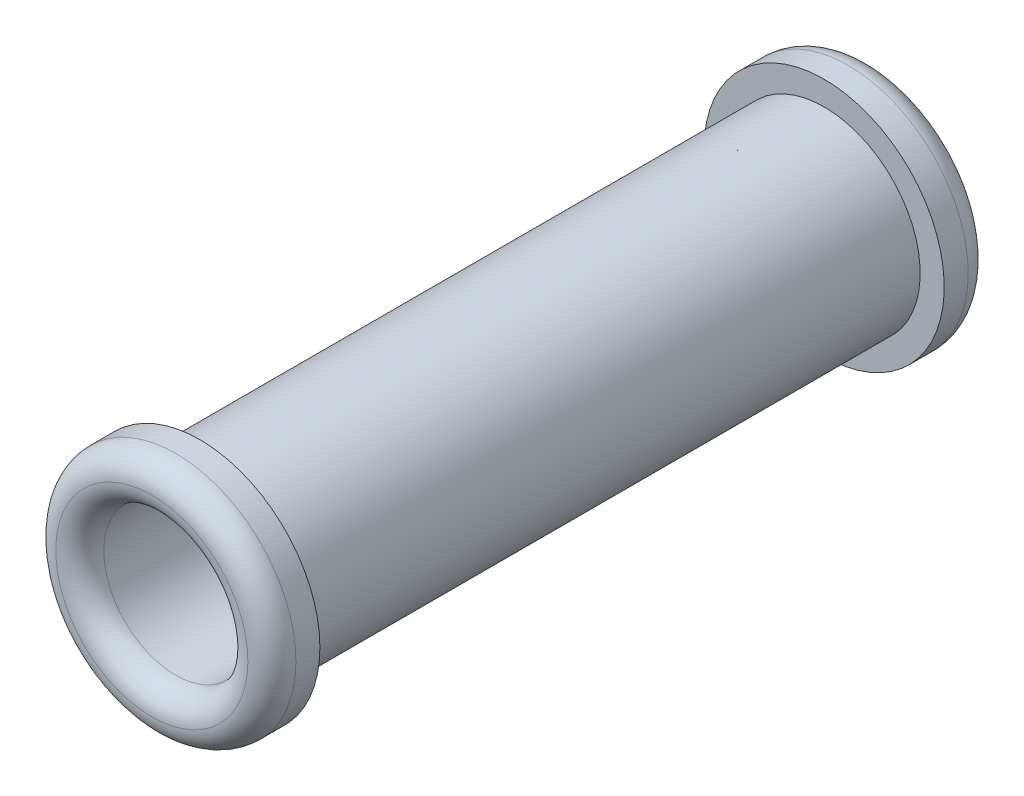
ISO-10303-21;
HEADER;
FILE_DESCRIPTION(('STEP AP214'),'2;1');
FILE_NAME('part.step','',(''),(''),'','','');
FILE_SCHEMA(('AUTOMOTIVE_DESIGN { 1 0 10303 214 1 1 1 1 }'));
ENDSEC;
DATA;
#1=APPLICATION_CONTEXT('core data for automotive mechanical design processes');
#2=APPLICATION_PROTOCOL_DEFINITION('international standard','automotive_design',2000,#1);
#3=PRODUCT_CONTEXT('',#1,'mechanical');
#4=PRODUCT('Part','Part','',(#3));
#5=PRODUCT_RELATED_PRODUCT_CATEGORY('part','',(#4));
#6=PRODUCT_DEFINITION_FORMATION('','',#4);
#7=PRODUCT_DEFINITION_CONTEXT('part definition',#1,'design');
#8=PRODUCT_DEFINITION('design','',#6,#7);
#9=PRODUCT_DEFINITION_SHAPE('','',#8);
#10=(LENGTH_UNIT() NAMED_UNIT(*) SI_UNIT(.MILLI.,.METRE.));
#11=(NAMED_UNIT(*) PLANE_ANGLE_UNIT() SI_UNIT($,.RADIAN.));
#12=(NAMED_UNIT(*) SI_UNIT($,.STERADIAN.) SOLID_ANGLE_UNIT());
#13=UNCERTAINTY_MEASURE_WITH_UNIT(LENGTH_MEASURE(1.E-05),#10,'distance_accuracy_value','');
#14=(GEOMETRIC_REPRESENTATION_CONTEXT(3) GLOBAL_UNCERTAINTY_ASSIGNED_CONTEXT((#13)) GLOBAL_UNIT_ASSIGNED_CONTEXT((#10,
#11,#12)) REPRESENTATION_CONTEXT('',''));
#15=CARTESIAN_POINT('',(0.,0.,0.));
#16=DIRECTION('',(0.,0.,1.));
#17=DIRECTION('',(1.,0.,0.));
#18=AXIS2_PLACEMENT_3D('',#15,#16,#17);
#19=CARTESIAN_POINT('',(0.,0.,6.5));
#20=DIRECTION('',(0.,0.,-1.));
#21=DIRECTION('',(-1.,0.,0.));
#22=AXIS2_PLACEMENT_3D('',#19,#20,#21);
#23=CYLINDRICAL_SURFACE('',#22,1.);
#24=CARTESIAN_POINT('',(0.,0.,6.5));
#25=DIRECTION('',(0.,0.,1.));
#26=DIRECTION('',(1.,0.,0.));
#27=AXIS2_PLACEMENT_3D('',#24,#25,#26);
#28=CIRCLE('',#27,1.);
#29=CARTESIAN_POINT('',(-1.,0.,6.5));
#30=VERTEX_POINT('',#29);
#31=EDGE_CURVE('E123',#30,#30,#28,.T.);
#32=CARTESIAN_POINT('',(0.,0.,0.));
#33=DIRECTION('',(0.,0.,1.));
#34=DIRECTION('',(1.,0.,0.));
#35=AXIS2_PLACEMENT_3D('',#32,#33,#34);
#36=CIRCLE('',#35,1.);
#37=CARTESIAN_POINT('',(-1.,0.,0.));
#38=VERTEX_POINT('',#37);
#39=EDGE_CURVE('E63',#38,#38,#36,.T.);
#40=CARTESIAN_POINT('',(-1.,0.,6.5));
#41=CARTESIAN_POINT('',(-1.,0.,6.43229166666667));
#42=CARTESIAN_POINT('',(-1.,0.,6.36458333333333));
#43=CARTESIAN_POINT('',(-1.,0.,6.22916666666667));
#44=CARTESIAN_POINT('',(-1.,0.,6.16145833333333));
#45=CARTESIAN_POINT('',(-1.,0.,6.02604166666667));
#46=CARTESIAN_POINT('',(-1.,0.,5.95833333333333));
#47=CARTESIAN_POINT('',(-1.,0.,5.82291666666667));
#48=CARTESIAN_POINT('',(-1.,0.,5.75520833333333));
#49=CARTESIAN_POINT('',(-1.,0.,5.61979166666667));
#50=CARTESIAN_POINT('',(-1.,0.,5.55208333333333));
#51=CARTESIAN_POINT('',(-1.,0.,5.41666666666667));
#52=CARTESIAN_POINT('',(-1.,0.,5.34895833333333));
#53=CARTESIAN_POINT('',(-1.,0.,5.21354166666667));
#54=CARTESIAN_POINT('',(-1.,0.,5.14583333333333));
#55=CARTESIAN_POINT('',(-1.,0.,5.01041666666667));
#56=CARTESIAN_POINT('',(-1.,0.,4.94270833333333));
#57=CARTESIAN_POINT('',(-1.,0.,4.80729166666667));
#58=CARTESIAN_POINT('',(-1.,0.,4.73958333333333));
#59=CARTESIAN_POINT('',(-1.,0.,4.60416666666667));
#60=CARTESIAN_POINT('',(-1.,0.,4.53645833333333));
#61=CARTESIAN_POINT('',(-1.,0.,4.40104166666667));
#62=CARTESIAN_POINT('',(-1.,0.,4.33333333333333));
#63=CARTESIAN_POINT('',(-1.,0.,4.19791666666667));
#64=CARTESIAN_POINT('',(-1.,0.,4.13020833333333));
#65=CARTESIAN_POINT('',(-1.,0.,3.99479166666667));
#66=CARTESIAN_POINT('',(-1.,0.,3.92708333333333));
#67=CARTESIAN_POINT('',(-1.,0.,3.79166666666667));
#68=CARTESIAN_POINT('',(-1.,0.,3.72395833333333));
#69=CARTESIAN_POINT('',(-1.,0.,3.58854166666667));
#70=CARTESIAN_POINT('',(-1.,0.,3.52083333333333));
#71=CARTESIAN_POINT('',(-1.,0.,3.38541666666667));
#72=CARTESIAN_POINT('',(-1.,0.,3.31770833333333));
#73=CARTESIAN_POINT('',(-1.,0.,3.18229166666667));
#74=CARTESIAN_POINT('',(-1.,0.,3.11458333333333));
#75=CARTESIAN_POINT('',(-1.,0.,2.97916666666667));
#76=CARTESIAN_POINT('',(-1.,0.,2.91145833333333));
#77=CARTESIAN_POINT('',(-1.,0.,2.77604166666667));
#78=CARTESIAN_POINT('',(-1.,0.,2.70833333333333));
#79=CARTESIAN_POINT('',(-1.,0.,2.57291666666667));
#80=CARTESIAN_POINT('',(-1.,0.,2.50520833333333));
#81=CARTESIAN_POINT('',(-1.,0.,2.36979166666667));
#82=CARTESIAN_POINT('',(-1.,0.,2.30208333333333));
#83=CARTESIAN_POINT('',(-1.,0.,2.16666666666667));
#84=CARTESIAN_POINT('',(-1.,0.,2.09895833333333));
#85=CARTESIAN_POINT('',(-1.,0.,1.96354166666667));
#86=CARTESIAN_POINT('',(-1.,0.,1.89583333333333));
#87=CARTESIAN_POINT('',(-1.,0.,1.76041666666667));
#88=CARTESIAN_POINT('',(-1.,0.,1.69270833333333));
#89=CARTESIAN_POINT('',(-1.,0.,1.55729166666667));
#90=CARTESIAN_POINT('',(-1.,0.,1.48958333333333));
#91=CARTESIAN_POINT('',(-1.,0.,1.35416666666667));
#92=CARTESIAN_POINT('',(-1.,0.,1.28645833333333));
#93=CARTESIAN_POINT('',(-1.,0.,1.15104166666667));
#94=CARTESIAN_POINT('',(-1.,0.,1.08333333333333));
#95=CARTESIAN_POINT('',(-1.,0.,0.947916666666667));
#96=CARTESIAN_POINT('',(-1.,0.,0.880208333333333));
#97=CARTESIAN_POINT('',(-1.,0.,0.744791666666667));
#98=CARTESIAN_POINT('',(-1.,0.,0.677083333333333));
#99=CARTESIAN_POINT('',(-1.,0.,0.541666666666667));
#100=CARTESIAN_POINT('',(-1.,0.,0.473958333333333));
#101=CARTESIAN_POINT('',(-1.,0.,0.338541666666667));
#102=CARTESIAN_POINT('',(-1.,0.,0.270833333333334));
#103=CARTESIAN_POINT('',(-1.,0.,0.135416666666667));
#104=CARTESIAN_POINT('',(-1.,0.,0.0677083333333334));
#105=CARTESIAN_POINT('',(-1.,0.,0.));
#106=B_SPLINE_CURVE_WITH_KNOTS('',3,(#40,#41,#42,#43,#44,#45,#46,#47,#48,#49,#50,#51,#52,#53,
#54,#55,#56,#57,#58,#59,#60,#61,#62,#63,#64,#65,#66,#67,#68,#69,#70,#71,#72,#73,#74,#75,#76,#77,
#78,#79,#80,#81,#82,#83,#84,#85,#86,#87,#88,#89,#90,#91,#92,#93,#94,#95,#96,#97,#98,#99,#100,
#101,#102,#103,#104,#105),.UNSPECIFIED.,.F.,.F.,(4,2,2,2,2,2,2,2,2,2,2,2,2,2,2,2,2,2,2,2,2,2,2,
2,2,2,2,2,2,2,2,2,4),(0.,0.203125,0.40625,0.609375000000001,0.812500000000001,1.015625,1.21875,
1.421875,1.625,1.828125,2.03125,2.234375,2.4375,2.640625,2.84375,3.046875,3.25,3.453125,3.65625,
3.859375,4.0625,4.265625,4.46875,4.671875,4.875,5.078125,5.28125,5.484375,5.6875,5.890625,
6.09375,6.296875,6.5),.UNSPECIFIED.);
#107=EDGE_CURVE('BSEAM36',#30,#38,#106,.T.);
#108=ORIENTED_EDGE('',*,*,#31,.F.);
#109=ORIENTED_EDGE('',*,*,#39,.T.);
#110=ORIENTED_EDGE('',*,*,#107,.T.);
#111=ORIENTED_EDGE('',*,*,#107,.F.);
#112=EDGE_LOOP('',(#108,#110,#109,#111));
#113=FACE_BOUND('',#112,.T.);
#114=ADVANCED_FACE('F36',(#113),#23,.T.);
#115=CARTESIAN_POINT('',(0.,0.,7.));
#116=DIRECTION('',(0.,0.,-1.));
#117=DIRECTION('',(-1.,0.,0.));
#118=AXIS2_PLACEMENT_3D('',#115,#116,#117);
#119=CYLINDRICAL_SURFACE('',#118,1.25);
#120=CARTESIAN_POINT('',(0.,0.,6.75));
#121=DIRECTION('',(0.,0.,1.));
#122=DIRECTION('',(1.,0.,0.));
#123=AXIS2_PLACEMENT_3D('',#120,#121,#122);
#124=CIRCLE('',#123,1.25);
#125=CARTESIAN_POINT('',(1.25,0.,6.75));
#126=VERTEX_POINT('',#125);
#127=EDGE_CURVE('E10',#126,#126,#124,.F.);
#128=ORIENTED_EDGE('',*,*,#127,.T.);
#129=EDGE_LOOP('',(#128));
#130=FACE_BOUND('',#129,.T.);
#131=CARTESIAN_POINT('',(0.,0.,6.5));
#132=DIRECTION('',(0.,0.,1.));
#133=DIRECTION('',(1.,0.,0.));
#134=AXIS2_PLACEMENT_3D('',#131,#132,#133);
#135=CIRCLE('',#134,1.25);
#136=CARTESIAN_POINT('',(1.25,0.,6.5));
#137=VERTEX_POINT('',#136);
#138=EDGE_CURVE('E126',#137,#137,#135,.T.);
#139=ORIENTED_EDGE('',*,*,#138,.T.);
#140=EDGE_LOOP('',(#139));
#141=FACE_BOUND('',#140,.T.);
#142=ADVANCED_FACE('F81',(#130,#141),#119,.T.);
#143=CARTESIAN_POINT('',(0.,0.,6.5));
#144=DIRECTION('',(0.,0.,1.));
#145=DIRECTION('',(1.,0.,0.));
#146=AXIS2_PLACEMENT_3D('',#143,#144,#145);
#147=PLANE('',#146);
#148=ORIENTED_EDGE('',*,*,#31,.T.);
#149=EDGE_LOOP('',(#148));
#150=FACE_BOUND('',#149,.T.);
#151=ORIENTED_EDGE('',*,*,#138,.F.);
#152=EDGE_LOOP('',(#151));
#153=FACE_BOUND('',#152,.T.);
#154=ADVANCED_FACE('F87',(#150,#153),#147,.F.);
#155=CARTESIAN_POINT('',(0.,0.,-0.5));
#156=DIRECTION('',(0.,0.,1.));
#157=DIRECTION('',(1.,0.,0.));
#158=AXIS2_PLACEMENT_3D('',#155,#156,#157);
#159=CYLINDRICAL_SURFACE('',#158,1.25);
#160=CARTESIAN_POINT('',(0.,0.,-0.25));
#161=DIRECTION('',(0.,0.,-1.));
#162=DIRECTION('',(-1.,0.,0.));
#163=AXIS2_PLACEMENT_3D('',#160,#161,#162);
#164=CIRCLE('',#163,1.25);
#165=CARTESIAN_POINT('',(-1.25,0.,-0.25));
#166=VERTEX_POINT('',#165);
#167=EDGE_CURVE('E45',#166,#166,#164,.F.);
#168=ORIENTED_EDGE('',*,*,#167,.T.);
#169=EDGE_LOOP('',(#168));
#170=FACE_BOUND('',#169,.T.);
#171=CARTESIAN_POINT('',(0.,0.,0.));
#172=DIRECTION('',(0.,0.,-1.));
#173=DIRECTION('',(-1.,0.,0.));
#174=AXIS2_PLACEMENT_3D('',#171,#172,#173);
#175=CIRCLE('',#174,1.25);
#176=CARTESIAN_POINT('',(-1.25,0.,0.));
#177=VERTEX_POINT('',#176);
#178=EDGE_CURVE('E57',#177,#177,#175,.T.);
#179=ORIENTED_EDGE('',*,*,#178,.T.);
#180=EDGE_LOOP('',(#179));
#181=FACE_BOUND('',#180,.T.);
#182=ADVANCED_FACE('F105',(#170,#181),#159,.T.);
#183=CARTESIAN_POINT('',(0.,0.,0.));
#184=DIRECTION('',(0.,0.,-1.));
#185=DIRECTION('',(-1.,0.,0.));
#186=AXIS2_PLACEMENT_3D('',#183,#184,#185);
#187=PLANE('',#186);
#188=ORIENTED_EDGE('',*,*,#39,.F.);
#189=EDGE_LOOP('',(#188));
#190=FACE_BOUND('',#189,.T.);
#191=ORIENTED_EDGE('',*,*,#178,.F.);
#192=EDGE_LOOP('',(#191));
#193=FACE_BOUND('',#192,.T.);
#194=ADVANCED_FACE('F99',(#190,#193),#187,.F.);
#195=CARTESIAN_POINT('',(0.,0.,-3.5));
#196=DIRECTION('',(0.,0.,1.));
#197=DIRECTION('',(1.,0.,0.));
#198=AXIS2_PLACEMENT_3D('',#195,#196,#197);
#199=CYLINDRICAL_SURFACE('',#198,0.75);
#200=CARTESIAN_POINT('',(0.,0.,-0.25));
#201=DIRECTION('',(0.,0.,-1.));
#202=DIRECTION('',(-1.,0.,0.));
#203=AXIS2_PLACEMENT_3D('',#200,#201,#202);
#204=CIRCLE('',#203,0.75);
#205=CARTESIAN_POINT('',(0.75,0.,-0.25));
#206=VERTEX_POINT('',#205);
#207=EDGE_CURVE('E51',#206,#206,#204,.T.);
#208=CARTESIAN_POINT('',(0.,0.,6.75));
#209=DIRECTION('',(0.,0.,1.));
#210=DIRECTION('',(1.,0.,0.));
#211=AXIS2_PLACEMENT_3D('',#208,#209,#210);
#212=CIRCLE('',#211,0.75);
#213=CARTESIAN_POINT('',(0.75,0.,6.75));
#214=VERTEX_POINT('',#213);
#215=EDGE_CURVE('E132',#214,#214,#212,.T.);
#216=CARTESIAN_POINT('',(0.75,0.,-0.25));
#217=CARTESIAN_POINT('',(0.75,0.,-0.177083333333333));
#218=CARTESIAN_POINT('',(0.75,0.,-0.104166666666667));
#219=CARTESIAN_POINT('',(0.75,0.,0.0416666666666667));
#220=CARTESIAN_POINT('',(0.75,0.,0.114583333333333));
#221=CARTESIAN_POINT('',(0.75,0.,0.260416666666667));
#222=CARTESIAN_POINT('',(0.75,0.,0.333333333333333));
#223=CARTESIAN_POINT('',(0.75,0.,0.479166666666666));
#224=CARTESIAN_POINT('',(0.75,0.,0.552083333333333));
#225=CARTESIAN_POINT('',(0.75,0.,0.697916666666666));
#226=CARTESIAN_POINT('',(0.75,0.,0.770833333333333));
#227=CARTESIAN_POINT('',(0.75,0.,0.916666666666666));
#228=CARTESIAN_POINT('',(0.75,0.,0.989583333333333));
#229=CARTESIAN_POINT('',(0.75,0.,1.13541666666667));
#230=CARTESIAN_POINT('',(0.75,0.,1.20833333333333));
#231=CARTESIAN_POINT('',(0.75,0.,1.35416666666667));
#232=CARTESIAN_POINT('',(0.75,0.,1.42708333333333));
#233=CARTESIAN_POINT('',(0.75,0.,1.57291666666667));
#234=CARTESIAN_POINT('',(0.75,0.,1.64583333333333));
#235=CARTESIAN_POINT('',(0.75,0.,1.79166666666667));
#236=CARTESIAN_POINT('',(0.75,0.,1.86458333333333));
#237=CARTESIAN_POINT('',(0.75,0.,2.01041666666667));
#238=CARTESIAN_POINT('',(0.75,0.,2.08333333333333));
#239=CARTESIAN_POINT('',(0.75,0.,2.22916666666667));
#240=CARTESIAN_POINT('',(0.75,0.,2.30208333333333));
#241=CARTESIAN_POINT('',(0.75,0.,2.44791666666667));
#242=CARTESIAN_POINT('',(0.75,0.,2.52083333333333));
#243=CARTESIAN_POINT('',(0.75,0.,2.66666666666666));
#244=CARTESIAN_POINT('',(0.75,0.,2.73958333333333));
#245=CARTESIAN_POINT('',(0.75,0.,2.88541666666667));
#246=CARTESIAN_POINT('',(0.75,0.,2.95833333333333));
#247=CARTESIAN_POINT('',(0.75,0.,3.10416666666667));
#248=CARTESIAN_POINT('',(0.75,0.,3.17708333333333));
#249=CARTESIAN_POINT('',(0.75,0.,3.32291666666667));
#250=CARTESIAN_POINT('',(0.75,0.,3.39583333333333));
#251=CARTESIAN_POINT('',(0.75,0.,3.54166666666666));
#252=CARTESIAN_POINT('',(0.75,0.,3.61458333333333));
#253=CARTESIAN_POINT('',(0.75,0.,3.76041666666666));
#254=CARTESIAN_POINT('',(0.75,0.,3.83333333333333));
#255=CARTESIAN_POINT('',(0.75,0.,3.97916666666666));
#256=CARTESIAN_POINT('',(0.75,0.,4.05208333333333));
#257=CARTESIAN_POINT('',(0.75,0.,4.19791666666666));
#258=CARTESIAN_POINT('',(0.75,0.,4.27083333333333));
#259=CARTESIAN_POINT('',(0.75,0.,4.41666666666666));
#260=CARTESIAN_POINT('',(0.75,0.,4.48958333333333));
#261=CARTESIAN_POINT('',(0.75,0.,4.63541666666666));
#262=CARTESIAN_POINT('',(0.75,0.,4.70833333333333));
#263=CARTESIAN_POINT('',(0.75,0.,4.85416666666666));
#264=CARTESIAN_POINT('',(0.75,0.,4.92708333333333));
#265=CARTESIAN_POINT('',(0.75,0.,5.07291666666666));
#266=CARTESIAN_POINT('',(0.75,0.,5.14583333333333));
#267=CARTESIAN_POINT('',(0.75,0.,5.29166666666666));
#268=CARTESIAN_POINT('',(0.75,0.,5.36458333333333));
#269=CARTESIAN_POINT('',(0.75,0.,5.51041666666666));
#270=CARTESIAN_POINT('',(0.75,0.,5.58333333333333));
#271=CARTESIAN_POINT('',(0.75,0.,5.72916666666666));
#272=CARTESIAN_POINT('',(0.75,0.,5.80208333333333));
#273=CARTESIAN_POINT('',(0.75,0.,5.94791666666666));
#274=CARTESIAN_POINT('',(0.75,0.,6.02083333333333));
#275=CARTESIAN_POINT('',(0.75,0.,6.16666666666666));
#276=CARTESIAN_POINT('',(0.75,0.,6.23958333333333));
#277=CARTESIAN_POINT('',(0.75,0.,6.38541666666666));
#278=CARTESIAN_POINT('',(0.75,0.,6.45833333333333));
#279=CARTESIAN_POINT('',(0.75,0.,6.60416666666666));
#280=CARTESIAN_POINT('',(0.75,0.,6.67708333333333));
#281=CARTESIAN_POINT('',(0.75,0.,6.75));
#282=B_SPLINE_CURVE_WITH_KNOTS('',3,(#216,#217,#218,#219,#220,#221,#222,#223,#224,#225,#226,
#227,#228,#229,#230,#231,#232,#233,#234,#235,#236,#237,#238,#239,#240,#241,#242,#243,#244,#245,
#246,#247,#248,#249,#250,#251,#252,#253,#254,#255,#256,#257,#258,#259,#260,#261,#262,#263,#264,
#265,#266,#267,#268,#269,#270,#271,#272,#273,#274,#275,#276,#277,#278,#279,#280,#281),
.UNSPECIFIED.,.F.,.F.,(4,2,2,2,2,2,2,2,2,2,2,2,2,2,2,2,2,2,2,2,2,2,2,2,2,2,2,2,2,2,2,2,4),(0.,
0.21875,0.4375,0.656249999999999,0.874999999999999,1.09375,1.3125,1.53125,1.75,1.96875,2.1875,
2.40625,2.625,2.84375,3.0625,3.28125,3.5,3.71875,3.9375,4.15625,4.375,4.59375,4.8125,5.03125,
5.25,5.46875,5.6875,5.90625,6.12499999999999,6.34375,6.5625,6.78125,7.),.UNSPECIFIED.);
#283=EDGE_CURVE('BSEAM94',#206,#214,#282,.T.);
#284=ORIENTED_EDGE('',*,*,#207,.T.);
#285=ORIENTED_EDGE('',*,*,#215,.T.);
#286=ORIENTED_EDGE('',*,*,#283,.T.);
#287=ORIENTED_EDGE('',*,*,#283,.F.);
#288=EDGE_LOOP('',(#284,#286,#285,#287));
#289=FACE_BOUND('',#288,.T.);
#290=ADVANCED_FACE('F94',(#289),#199,.F.);
#291=CARTESIAN_POINT('',(0.,0.,-0.25));
#292=DIRECTION('',(0.,0.,-1.));
#293=DIRECTION('',(-1.,0.,0.));
#294=AXIS2_PLACEMENT_3D('',#291,#292,#293);
#295=TOROIDAL_SURFACE('',#294,1.,0.25);
#296=ORIENTED_EDGE('',*,*,#167,.F.);
#297=EDGE_LOOP('',(#296));
#298=FACE_BOUND('',#297,.T.);
#299=CARTESIAN_POINT('',(0.,0.,-0.5));
#300=DIRECTION('',(0.,0.,-1.));
#301=DIRECTION('',(-1.,0.,0.));
#302=AXIS2_PLACEMENT_3D('',#299,#300,#301);
#303=CIRCLE('',#302,1.);
#304=CARTESIAN_POINT('',(-1.,0.,-0.5));
#305=VERTEX_POINT('',#304);
#306=EDGE_CURVE('E54',#305,#305,#303,.T.);
#307=ORIENTED_EDGE('',*,*,#306,.F.);
#308=EDGE_LOOP('',(#307));
#309=FACE_BOUND('',#308,.T.);
#310=ADVANCED_FACE('F78',(#298,#309),#295,.T.);
#311=CARTESIAN_POINT('',(0.,0.,-0.25));
#312=DIRECTION('',(0.,0.,-1.));
#313=DIRECTION('',(-1.,0.,0.));
#314=AXIS2_PLACEMENT_3D('',#311,#312,#313);
#315=TOROIDAL_SURFACE('',#314,1.,0.25);
#316=ORIENTED_EDGE('',*,*,#306,.T.);
#317=EDGE_LOOP('',(#316));
#318=FACE_BOUND('',#317,.T.);
#319=ORIENTED_EDGE('',*,*,#207,.F.);
#320=EDGE_LOOP('',(#319));
#321=FACE_BOUND('',#320,.T.);
#322=ADVANCED_FACE('F72',(#318,#321),#315,.T.);
#323=CARTESIAN_POINT('',(0.,0.,6.75));
#324=DIRECTION('',(0.,0.,1.));
#325=DIRECTION('',(1.,0.,0.));
#326=AXIS2_PLACEMENT_3D('',#323,#324,#325);
#327=TOROIDAL_SURFACE('',#326,1.,0.25);
#328=ORIENTED_EDGE('',*,*,#127,.F.);
#329=EDGE_LOOP('',(#328));
#330=FACE_BOUND('',#329,.T.);
#331=CARTESIAN_POINT('',(0.,0.,7.));
#332=DIRECTION('',(0.,0.,1.));
#333=DIRECTION('',(1.,0.,0.));
#334=AXIS2_PLACEMENT_3D('',#331,#332,#333);
#335=CIRCLE('',#334,1.);
#336=CARTESIAN_POINT('',(1.,0.,7.));
#337=VERTEX_POINT('',#336);
#338=EDGE_CURVE('E40',#337,#337,#335,.T.);
#339=ORIENTED_EDGE('',*,*,#338,.F.);
#340=EDGE_LOOP('',(#339));
#341=FACE_BOUND('',#340,.T.);
#342=ADVANCED_FACE('F38',(#330,#341),#327,.T.);
#343=CARTESIAN_POINT('',(0.,0.,6.75));
#344=DIRECTION('',(0.,0.,1.));
#345=DIRECTION('',(1.,0.,0.));
#346=AXIS2_PLACEMENT_3D('',#343,#344,#345);
#347=TOROIDAL_SURFACE('',#346,1.,0.25);
#348=ORIENTED_EDGE('',*,*,#338,.T.);
#349=EDGE_LOOP('',(#348));
#350=FACE_BOUND('',#349,.T.);
#351=ORIENTED_EDGE('',*,*,#215,.F.);
#352=EDGE_LOOP('',(#351));
#353=FACE_BOUND('',#352,.T.);
#354=ADVANCED_FACE('F68',(#350,#353),#347,.T.);
#355=CLOSED_SHELL('',(#114,#142,#154,#182,#194,#290,#310,#322,#342,#354));
#356=MANIFOLD_SOLID_BREP('B2',#355);
#357=ADVANCED_BREP_SHAPE_REPRESENTATION('',(#18,#356),#14);
#358=SHAPE_DEFINITION_REPRESENTATION(#9,#357);
ENDSEC;
END-ISO-10303-21;
